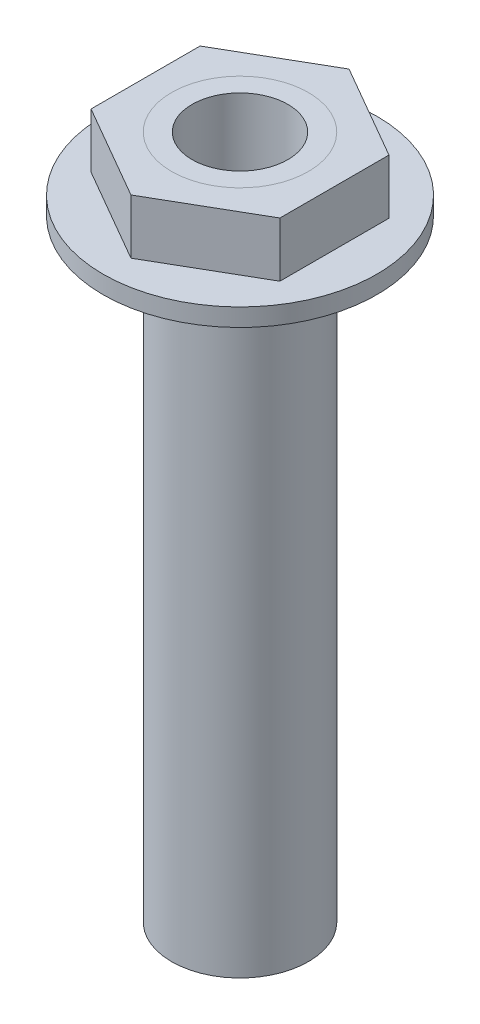
ISO-10303-21;
HEADER;
FILE_DESCRIPTION(('STEP AP214'),'2;1');
FILE_NAME('part.step','',(''),(''),'','','');
FILE_SCHEMA(('AUTOMOTIVE_DESIGN { 1 0 10303 214 1 1 1 1 }'));
ENDSEC;
DATA;
#1=APPLICATION_CONTEXT('core data for automotive mechanical design processes');
#2=APPLICATION_PROTOCOL_DEFINITION('international standard','automotive_design',2000,#1);
#3=PRODUCT_CONTEXT('',#1,'mechanical');
#4=PRODUCT('Part','Part','',(#3));
#5=PRODUCT_RELATED_PRODUCT_CATEGORY('part','',(#4));
#6=PRODUCT_DEFINITION_FORMATION('','',#4);
#7=PRODUCT_DEFINITION_CONTEXT('part definition',#1,'design');
#8=PRODUCT_DEFINITION('design','',#6,#7);
#9=PRODUCT_DEFINITION_SHAPE('','',#8);
#10=(LENGTH_UNIT() NAMED_UNIT(*) SI_UNIT(.MILLI.,.METRE.));
#11=(NAMED_UNIT(*) PLANE_ANGLE_UNIT() SI_UNIT($,.RADIAN.));
#12=(NAMED_UNIT(*) SI_UNIT($,.STERADIAN.) SOLID_ANGLE_UNIT());
#13=UNCERTAINTY_MEASURE_WITH_UNIT(LENGTH_MEASURE(1.E-05),#10,'distance_accuracy_value','');
#14=(GEOMETRIC_REPRESENTATION_CONTEXT(3) GLOBAL_UNCERTAINTY_ASSIGNED_CONTEXT((#13)) GLOBAL_UNIT_ASSIGNED_CONTEXT((#10,
#11,#12)) REPRESENTATION_CONTEXT('',''));
#15=CARTESIAN_POINT('',(0.,0.,0.));
#16=DIRECTION('',(0.,0.,1.));
#17=DIRECTION('',(1.,0.,0.));
#18=AXIS2_PLACEMENT_3D('',#15,#16,#17);
#19=CARTESIAN_POINT('',(0.,44.7,0.));
#20=DIRECTION('',(0.,-1.,0.));
#21=DIRECTION('',(0.,0.,-1.));
#22=AXIS2_PLACEMENT_3D('',#19,#20,#21);
#23=PLANE('',#22);
#24=CARTESIAN_POINT('',(0.,44.7,0.));
#25=DIRECTION('',(0.,-1.,0.));
#26=DIRECTION('',(0.,0.,-1.));
#27=AXIS2_PLACEMENT_3D('',#24,#25,#26);
#28=CIRCLE('',#27,10.);
#29=CARTESIAN_POINT('',(0.,44.7,-10.));
#30=VERTEX_POINT('',#29);
#31=EDGE_CURVE('E11',#30,#30,#28,.T.);
#32=ORIENTED_EDGE('',*,*,#31,.T.);
#33=EDGE_LOOP('',(#32));
#34=FACE_BOUND('',#33,.T.);
#35=CARTESIAN_POINT('',(0.,44.7,0.));
#36=DIRECTION('',(0.,-1.,0.));
#37=DIRECTION('',(0.,0.,-1.));
#38=AXIS2_PLACEMENT_3D('',#35,#36,#37);
#39=CIRCLE('',#38,5.);
#40=CARTESIAN_POINT('',(0.,44.7,-5.));
#41=VERTEX_POINT('',#40);
#42=EDGE_CURVE('E66',#41,#41,#39,.T.);
#43=ORIENTED_EDGE('',*,*,#42,.F.);
#44=EDGE_LOOP('',(#43));
#45=FACE_BOUND('',#44,.T.);
#46=ADVANCED_FACE('F52',(#34,#45),#23,.T.);
#47=CARTESIAN_POINT('',(0.,46.,0.));
#48=DIRECTION('',(0.,-1.,0.));
#49=DIRECTION('',(0.,0.,-1.));
#50=AXIS2_PLACEMENT_3D('',#47,#48,#49);
#51=PLANE('',#50);
#52=CARTESIAN_POINT('',(0.,46.,0.));
#53=DIRECTION('',(0.,-1.,0.));
#54=DIRECTION('',(0.,0.,-1.));
#55=AXIS2_PLACEMENT_3D('',#52,#53,#54);
#56=CIRCLE('',#55,10.);
#57=CARTESIAN_POINT('',(0.,46.,-10.));
#58=VERTEX_POINT('',#57);
#59=EDGE_CURVE('E56',#58,#58,#56,.T.);
#60=ORIENTED_EDGE('',*,*,#59,.F.);
#61=EDGE_LOOP('',(#60));
#62=FACE_BOUND('',#61,.T.);
#63=CARTESIAN_POINT('',(0.,46.,0.));
#64=DIRECTION('',(0.,-1.,0.));
#65=DIRECTION('',(0.,0.,-1.));
#66=AXIS2_PLACEMENT_3D('',#63,#64,#65);
#67=CIRCLE('',#66,5.);
#68=CARTESIAN_POINT('',(0.,46.,-5.));
#69=VERTEX_POINT('',#68);
#70=EDGE_CURVE('E68',#69,#69,#67,.T.);
#71=ORIENTED_EDGE('',*,*,#70,.T.);
#72=EDGE_LOOP('',(#71));
#73=FACE_BOUND('',#72,.T.);
#74=ADVANCED_FACE('F79',(#62,#73),#51,.F.);
#75=CARTESIAN_POINT('',(0.,44.7,0.));
#76=DIRECTION('',(0.,1.,0.));
#77=DIRECTION('',(0.,0.,1.));
#78=AXIS2_PLACEMENT_3D('',#75,#76,#77);
#79=CYLINDRICAL_SURFACE('',#78,10.);
#80=ORIENTED_EDGE('',*,*,#31,.F.);
#81=EDGE_LOOP('',(#80));
#82=FACE_BOUND('',#81,.T.);
#83=ORIENTED_EDGE('',*,*,#59,.T.);
#84=EDGE_LOOP('',(#83));
#85=FACE_BOUND('',#84,.T.);
#86=ADVANCED_FACE('F54',(#82,#85),#79,.T.);
#87=CARTESIAN_POINT('',(0.,44.7,0.));
#88=DIRECTION('',(0.,1.,0.));
#89=DIRECTION('',(0.,0.,1.));
#90=AXIS2_PLACEMENT_3D('',#87,#88,#89);
#91=CYLINDRICAL_SURFACE('',#90,5.);
#92=ORIENTED_EDGE('',*,*,#42,.T.);
#93=EDGE_LOOP('',(#92));
#94=FACE_BOUND('',#93,.T.);
#95=ORIENTED_EDGE('',*,*,#70,.F.);
#96=EDGE_LOOP('',(#95));
#97=FACE_BOUND('',#96,.T.);
#98=ADVANCED_FACE('F75',(#94,#97),#91,.F.);
#99=CLOSED_SHELL('',(#46,#74,#86,#98));
#100=MANIFOLD_SOLID_BREP('B2',#99);
#101=CARTESIAN_POINT('',(6.9,46.,-3.98371685740842));
#102=DIRECTION('',(0.5,0.,-0.866025403784439));
#103=DIRECTION('',(-0.866025403784439,0.,-0.5));
#104=AXIS2_PLACEMENT_3D('',#101,#102,#103);
#105=PLANE('',#104);
#106=DIRECTION('',(-0.866025403784439,0.,-0.5));
#107=VECTOR('',#106,1.);
#108=CARTESIAN_POINT('',(6.9,50.,-3.98371685740842));
#109=LINE('',#108,#107);
#110=CARTESIAN_POINT('',(6.9,50.,-3.98371685740842));
#111=VERTEX_POINT('',#110);
#112=CARTESIAN_POINT('',(0.,50.,-7.96743371481684));
#113=VERTEX_POINT('',#112);
#114=EDGE_CURVE('E230',#111,#113,#109,.T.);
#115=ORIENTED_EDGE('',*,*,#114,.F.);
#116=DIRECTION('',(0.,1.,0.));
#117=VECTOR('',#116,1.);
#118=CARTESIAN_POINT('',(6.9,46.,-3.98371685740842));
#119=LINE('',#118,#117);
#120=CARTESIAN_POINT('',(6.9,46.,-3.98371685740842));
#121=VERTEX_POINT('',#120);
#122=EDGE_CURVE('E50',#121,#111,#119,.T.);
#123=ORIENTED_EDGE('',*,*,#122,.F.);
#124=DIRECTION('',(-0.866025403784439,0.,-0.5));
#125=VECTOR('',#124,1.);
#126=CARTESIAN_POINT('',(6.9,46.,-3.98371685740842));
#127=LINE('',#126,#125);
#128=CARTESIAN_POINT('',(0.,46.,-7.96743371481684));
#129=VERTEX_POINT('',#128);
#130=EDGE_CURVE('E250',#121,#129,#127,.T.);
#131=ORIENTED_EDGE('',*,*,#130,.T.);
#132=DIRECTION('',(0.,1.,0.));
#133=VECTOR('',#132,1.);
#134=CARTESIAN_POINT('',(0.,46.,-7.96743371481684));
#135=LINE('',#134,#133);
#136=EDGE_CURVE('E129',#129,#113,#135,.T.);
#137=ORIENTED_EDGE('',*,*,#136,.T.);
#138=EDGE_LOOP('',(#115,#123,#131,#137));
#139=FACE_BOUND('',#138,.T.);
#140=ADVANCED_FACE('F126',(#139),#105,.T.);
#141=CARTESIAN_POINT('',(6.9,46.,3.98371685740842));
#142=DIRECTION('',(1.,0.,0.));
#143=DIRECTION('',(0.,0.,-1.));
#144=AXIS2_PLACEMENT_3D('',#141,#142,#143);
#145=PLANE('',#144);
#146=DIRECTION('',(0.,0.,-1.));
#147=VECTOR('',#146,1.);
#148=CARTESIAN_POINT('',(6.9,50.,3.98371685740842));
#149=LINE('',#148,#147);
#150=CARTESIAN_POINT('',(6.9,50.,3.98371685740842));
#151=VERTEX_POINT('',#150);
#152=EDGE_CURVE('E247',#151,#111,#149,.T.);
#153=ORIENTED_EDGE('',*,*,#152,.F.);
#154=DIRECTION('',(0.,1.,0.));
#155=VECTOR('',#154,1.);
#156=CARTESIAN_POINT('',(6.9,46.,3.98371685740842));
#157=LINE('',#156,#155);
#158=CARTESIAN_POINT('',(6.9,46.,3.98371685740842));
#159=VERTEX_POINT('',#158);
#160=EDGE_CURVE('E136',#159,#151,#157,.T.);
#161=ORIENTED_EDGE('',*,*,#160,.F.);
#162=DIRECTION('',(0.,0.,-1.));
#163=VECTOR('',#162,1.);
#164=CARTESIAN_POINT('',(6.9,46.,3.98371685740842));
#165=LINE('',#164,#163);
#166=EDGE_CURVE('E215',#159,#121,#165,.T.);
#167=ORIENTED_EDGE('',*,*,#166,.T.);
#168=ORIENTED_EDGE('',*,*,#122,.T.);
#169=EDGE_LOOP('',(#153,#161,#167,#168));
#170=FACE_BOUND('',#169,.T.);
#171=ADVANCED_FACE('F264',(#170),#145,.T.);
#172=CARTESIAN_POINT('',(0.,46.,7.96743371481684));
#173=DIRECTION('',(0.5,0.,0.866025403784439));
#174=DIRECTION('',(0.866025403784439,0.,-0.5));
#175=AXIS2_PLACEMENT_3D('',#172,#173,#174);
#176=PLANE('',#175);
#177=DIRECTION('',(0.866025403784439,0.,-0.5));
#178=VECTOR('',#177,1.);
#179=CARTESIAN_POINT('',(0.,50.,7.96743371481684));
#180=LINE('',#179,#178);
#181=CARTESIAN_POINT('',(0.,50.,7.96743371481684));
#182=VERTEX_POINT('',#181);
#183=EDGE_CURVE('E201',#182,#151,#180,.T.);
#184=ORIENTED_EDGE('',*,*,#183,.F.);
#185=DIRECTION('',(0.,1.,0.));
#186=VECTOR('',#185,1.);
#187=CARTESIAN_POINT('',(0.,46.,7.96743371481684));
#188=LINE('',#187,#186);
#189=CARTESIAN_POINT('',(0.,46.,7.96743371481684));
#190=VERTEX_POINT('',#189);
#191=EDGE_CURVE('E196',#190,#182,#188,.T.);
#192=ORIENTED_EDGE('',*,*,#191,.F.);
#193=DIRECTION('',(0.866025403784439,0.,-0.5));
#194=VECTOR('',#193,1.);
#195=CARTESIAN_POINT('',(0.,46.,7.96743371481684));
#196=LINE('',#195,#194);
#197=EDGE_CURVE('E199',#190,#159,#196,.T.);
#198=ORIENTED_EDGE('',*,*,#197,.T.);
#199=ORIENTED_EDGE('',*,*,#160,.T.);
#200=EDGE_LOOP('',(#184,#192,#198,#199));
#201=FACE_BOUND('',#200,.T.);
#202=ADVANCED_FACE('F198',(#201),#176,.T.);
#203=CARTESIAN_POINT('',(-6.9,46.,3.98371685740842));
#204=DIRECTION('',(-0.5,0.,0.866025403784439));
#205=DIRECTION('',(0.866025403784439,0.,0.5));
#206=AXIS2_PLACEMENT_3D('',#203,#204,#205);
#207=PLANE('',#206);
#208=DIRECTION('',(0.866025403784439,0.,0.5));
#209=VECTOR('',#208,1.);
#210=CARTESIAN_POINT('',(-6.9,50.,3.98371685740842));
#211=LINE('',#210,#209);
#212=CARTESIAN_POINT('',(-6.9,50.,3.98371685740842));
#213=VERTEX_POINT('',#212);
#214=EDGE_CURVE('E243',#213,#182,#211,.T.);
#215=ORIENTED_EDGE('',*,*,#214,.F.);
#216=DIRECTION('',(0.,1.,0.));
#217=VECTOR('',#216,1.);
#218=CARTESIAN_POINT('',(-6.9,46.,3.98371685740842));
#219=LINE('',#218,#217);
#220=CARTESIAN_POINT('',(-6.9,46.,3.98371685740842));
#221=VERTEX_POINT('',#220);
#222=EDGE_CURVE('E207',#221,#213,#219,.T.);
#223=ORIENTED_EDGE('',*,*,#222,.F.);
#224=DIRECTION('',(0.866025403784439,0.,0.5));
#225=VECTOR('',#224,1.);
#226=CARTESIAN_POINT('',(-6.9,46.,3.98371685740842));
#227=LINE('',#226,#225);
#228=EDGE_CURVE('E213',#221,#190,#227,.T.);
#229=ORIENTED_EDGE('',*,*,#228,.T.);
#230=ORIENTED_EDGE('',*,*,#191,.T.);
#231=EDGE_LOOP('',(#215,#223,#229,#230));
#232=FACE_BOUND('',#231,.T.);
#233=ADVANCED_FACE('F218',(#232),#207,.T.);
#234=CARTESIAN_POINT('',(-6.9,46.,-3.98371685740842));
#235=DIRECTION('',(-1.,0.,0.));
#236=DIRECTION('',(0.,0.,1.));
#237=AXIS2_PLACEMENT_3D('',#234,#235,#236);
#238=PLANE('',#237);
#239=DIRECTION('',(0.,0.,1.));
#240=VECTOR('',#239,1.);
#241=CARTESIAN_POINT('',(-6.9,50.,-3.98371685740842));
#242=LINE('',#241,#240);
#243=CARTESIAN_POINT('',(-6.9,50.,-3.98371685740842));
#244=VERTEX_POINT('',#243);
#245=EDGE_CURVE('E239',#244,#213,#242,.T.);
#246=ORIENTED_EDGE('',*,*,#245,.F.);
#247=DIRECTION('',(0.,1.,0.));
#248=VECTOR('',#247,1.);
#249=CARTESIAN_POINT('',(-6.9,46.,-3.98371685740842));
#250=LINE('',#249,#248);
#251=CARTESIAN_POINT('',(-6.9,46.,-3.98371685740842));
#252=VERTEX_POINT('',#251);
#253=EDGE_CURVE('E255',#252,#244,#250,.T.);
#254=ORIENTED_EDGE('',*,*,#253,.F.);
#255=DIRECTION('',(0.,0.,1.));
#256=VECTOR('',#255,1.);
#257=CARTESIAN_POINT('',(-6.9,46.,-3.98371685740842));
#258=LINE('',#257,#256);
#259=EDGE_CURVE('E220',#252,#221,#258,.T.);
#260=ORIENTED_EDGE('',*,*,#259,.T.);
#261=ORIENTED_EDGE('',*,*,#222,.T.);
#262=EDGE_LOOP('',(#246,#254,#260,#261));
#263=FACE_BOUND('',#262,.T.);
#264=ADVANCED_FACE('F277',(#263),#238,.T.);
#265=CARTESIAN_POINT('',(0.,46.,-7.96743371481684));
#266=DIRECTION('',(-0.5,0.,-0.866025403784439));
#267=DIRECTION('',(-0.866025403784439,0.,0.5));
#268=AXIS2_PLACEMENT_3D('',#265,#266,#267);
#269=PLANE('',#268);
#270=DIRECTION('',(-0.866025403784439,0.,0.5));
#271=VECTOR('',#270,1.);
#272=CARTESIAN_POINT('',(0.,50.,-7.96743371481684));
#273=LINE('',#272,#271);
#274=EDGE_CURVE('E234',#113,#244,#273,.T.);
#275=ORIENTED_EDGE('',*,*,#274,.F.);
#276=ORIENTED_EDGE('',*,*,#136,.F.);
#277=DIRECTION('',(-0.866025403784439,0.,0.5));
#278=VECTOR('',#277,1.);
#279=CARTESIAN_POINT('',(0.,46.,-7.96743371481684));
#280=LINE('',#279,#278);
#281=EDGE_CURVE('E224',#129,#252,#280,.T.);
#282=ORIENTED_EDGE('',*,*,#281,.T.);
#283=ORIENTED_EDGE('',*,*,#253,.T.);
#284=EDGE_LOOP('',(#275,#276,#282,#283));
#285=FACE_BOUND('',#284,.T.);
#286=ADVANCED_FACE('F261',(#285),#269,.T.);
#287=CARTESIAN_POINT('',(0.,46.,0.));
#288=DIRECTION('',(0.,1.,0.));
#289=DIRECTION('',(0.,0.,1.));
#290=AXIS2_PLACEMENT_3D('',#287,#288,#289);
#291=PLANE('',#290);
#292=CARTESIAN_POINT('',(0.,46.,0.));
#293=DIRECTION('',(0.,1.,0.));
#294=DIRECTION('',(0.,0.,1.));
#295=AXIS2_PLACEMENT_3D('',#292,#293,#294);
#296=CIRCLE('',#295,5.);
#297=CARTESIAN_POINT('',(0.,46.,5.));
#298=VERTEX_POINT('',#297);
#299=EDGE_CURVE('E235',#298,#298,#296,.T.);
#300=ORIENTED_EDGE('',*,*,#299,.T.);
#301=EDGE_LOOP('',(#300));
#302=FACE_BOUND('',#301,.T.);
#303=ORIENTED_EDGE('',*,*,#130,.F.);
#304=ORIENTED_EDGE('',*,*,#166,.F.);
#305=ORIENTED_EDGE('',*,*,#197,.F.);
#306=ORIENTED_EDGE('',*,*,#228,.F.);
#307=ORIENTED_EDGE('',*,*,#259,.F.);
#308=ORIENTED_EDGE('',*,*,#281,.F.);
#309=EDGE_LOOP('',(#303,#304,#305,#306,#307,#308));
#310=FACE_BOUND('',#309,.T.);
#311=ADVANCED_FACE('F211',(#302,#310),#291,.F.);
#312=CARTESIAN_POINT('',(0.,50.,0.));
#313=DIRECTION('',(0.,1.,0.));
#314=DIRECTION('',(0.,0.,1.));
#315=AXIS2_PLACEMENT_3D('',#312,#313,#314);
#316=PLANE('',#315);
#317=CARTESIAN_POINT('',(0.,50.,0.));
#318=DIRECTION('',(0.,1.,0.));
#319=DIRECTION('',(0.,0.,1.));
#320=AXIS2_PLACEMENT_3D('',#317,#318,#319);
#321=CIRCLE('',#320,5.);
#322=CARTESIAN_POINT('',(0.,50.,5.));
#323=VERTEX_POINT('',#322);
#324=EDGE_CURVE('E300',#323,#323,#321,.T.);
#325=ORIENTED_EDGE('',*,*,#324,.F.);
#326=EDGE_LOOP('',(#325));
#327=FACE_BOUND('',#326,.T.);
#328=ORIENTED_EDGE('',*,*,#114,.T.);
#329=ORIENTED_EDGE('',*,*,#274,.T.);
#330=ORIENTED_EDGE('',*,*,#245,.T.);
#331=ORIENTED_EDGE('',*,*,#214,.T.);
#332=ORIENTED_EDGE('',*,*,#183,.T.);
#333=ORIENTED_EDGE('',*,*,#152,.T.);
#334=EDGE_LOOP('',(#328,#329,#330,#331,#332,#333));
#335=FACE_BOUND('',#334,.T.);
#336=ADVANCED_FACE('F263',(#327,#335),#316,.T.);
#337=CARTESIAN_POINT('',(0.,46.,0.));
#338=DIRECTION('',(0.,1.,0.));
#339=DIRECTION('',(0.,0.,1.));
#340=AXIS2_PLACEMENT_3D('',#337,#338,#339);
#341=CYLINDRICAL_SURFACE('',#340,5.);
#342=ORIENTED_EDGE('',*,*,#299,.F.);
#343=EDGE_LOOP('',(#342));
#344=FACE_BOUND('',#343,.T.);
#345=ORIENTED_EDGE('',*,*,#324,.T.);
#346=EDGE_LOOP('',(#345));
#347=FACE_BOUND('',#346,.T.);
#348=ADVANCED_FACE('F288',(#344,#347),#341,.F.);
#349=CLOSED_SHELL('',(#140,#171,#202,#233,#264,#286,#311,#336,#348));
#350=MANIFOLD_SOLID_BREP('B6',#349);
#351=CARTESIAN_POINT('',(0.,50.,0.));
#352=DIRECTION('',(0.,1.,0.));
#353=DIRECTION('',(0.,0.,1.));
#354=AXIS2_PLACEMENT_3D('',#351,#352,#353);
#355=PLANE('',#354);
#356=CARTESIAN_POINT('',(0.,50.,0.));
#357=DIRECTION('',(0.,1.,0.));
#358=DIRECTION('',(0.,0.,1.));
#359=AXIS2_PLACEMENT_3D('',#356,#357,#358);
#360=CIRCLE('',#359,5.);
#361=CARTESIAN_POINT('',(0.,50.,5.));
#362=VERTEX_POINT('',#361);
#363=EDGE_CURVE('E125',#362,#362,#360,.T.);
#364=ORIENTED_EDGE('',*,*,#363,.T.);
#365=EDGE_LOOP('',(#364));
#366=FACE_BOUND('',#365,.T.);
#367=CARTESIAN_POINT('',(0.,50.,0.));
#368=DIRECTION('',(0.,1.,0.));
#369=DIRECTION('',(0.,0.,1.));
#370=AXIS2_PLACEMENT_3D('',#367,#368,#369);
#371=CIRCLE('',#370,3.5);
#372=CARTESIAN_POINT('',(0.,50.,3.5));
#373=VERTEX_POINT('',#372);
#374=EDGE_CURVE('E368',#373,#373,#371,.T.);
#375=ORIENTED_EDGE('',*,*,#374,.F.);
#376=EDGE_LOOP('',(#375));
#377=FACE_BOUND('',#376,.T.);
#378=ADVANCED_FACE('F354',(#366,#377),#355,.T.);
#379=CARTESIAN_POINT('',(0.,0.,0.));
#380=DIRECTION('',(0.,1.,0.));
#381=DIRECTION('',(0.,0.,1.));
#382=AXIS2_PLACEMENT_3D('',#379,#380,#381);
#383=PLANE('',#382);
#384=CARTESIAN_POINT('',(0.,0.,0.));
#385=DIRECTION('',(0.,1.,0.));
#386=DIRECTION('',(0.,0.,1.));
#387=AXIS2_PLACEMENT_3D('',#384,#385,#386);
#388=CIRCLE('',#387,5.);
#389=CARTESIAN_POINT('',(0.,0.,5.));
#390=VERTEX_POINT('',#389);
#391=EDGE_CURVE('E358',#390,#390,#388,.T.);
#392=ORIENTED_EDGE('',*,*,#391,.F.);
#393=EDGE_LOOP('',(#392));
#394=FACE_BOUND('',#393,.T.);
#395=CARTESIAN_POINT('',(0.,0.,0.));
#396=DIRECTION('',(0.,1.,0.));
#397=DIRECTION('',(0.,0.,1.));
#398=AXIS2_PLACEMENT_3D('',#395,#396,#397);
#399=CIRCLE('',#398,3.5);
#400=CARTESIAN_POINT('',(0.,0.,3.5));
#401=VERTEX_POINT('',#400);
#402=EDGE_CURVE('E370',#401,#401,#399,.T.);
#403=ORIENTED_EDGE('',*,*,#402,.T.);
#404=EDGE_LOOP('',(#403));
#405=FACE_BOUND('',#404,.T.);
#406=ADVANCED_FACE('F381',(#394,#405),#383,.F.);
#407=CARTESIAN_POINT('',(0.,50.,0.));
#408=DIRECTION('',(0.,-1.,0.));
#409=DIRECTION('',(0.,0.,-1.));
#410=AXIS2_PLACEMENT_3D('',#407,#408,#409);
#411=CYLINDRICAL_SURFACE('',#410,5.);
#412=ORIENTED_EDGE('',*,*,#363,.F.);
#413=EDGE_LOOP('',(#412));
#414=FACE_BOUND('',#413,.T.);
#415=ORIENTED_EDGE('',*,*,#391,.T.);
#416=EDGE_LOOP('',(#415));
#417=FACE_BOUND('',#416,.T.);
#418=ADVANCED_FACE('F356',(#414,#417),#411,.T.);
#419=CARTESIAN_POINT('',(0.,50.,0.));
#420=DIRECTION('',(0.,-1.,0.));
#421=DIRECTION('',(0.,0.,-1.));
#422=AXIS2_PLACEMENT_3D('',#419,#420,#421);
#423=CYLINDRICAL_SURFACE('',#422,3.5);
#424=ORIENTED_EDGE('',*,*,#374,.T.);
#425=EDGE_LOOP('',(#424));
#426=FACE_BOUND('',#425,.T.);
#427=ORIENTED_EDGE('',*,*,#402,.F.);
#428=EDGE_LOOP('',(#427));
#429=FACE_BOUND('',#428,.T.);
#430=ADVANCED_FACE('F377',(#426,#429),#423,.F.);
#431=CLOSED_SHELL('',(#378,#406,#418,#430));
#432=MANIFOLD_SOLID_BREP('B44',#431);
#433=ADVANCED_BREP_SHAPE_REPRESENTATION('',(#18,#100,#350,#432),#14);
#434=SHAPE_DEFINITION_REPRESENTATION(#9,#433);
ENDSEC;
END-ISO-10303-21;
